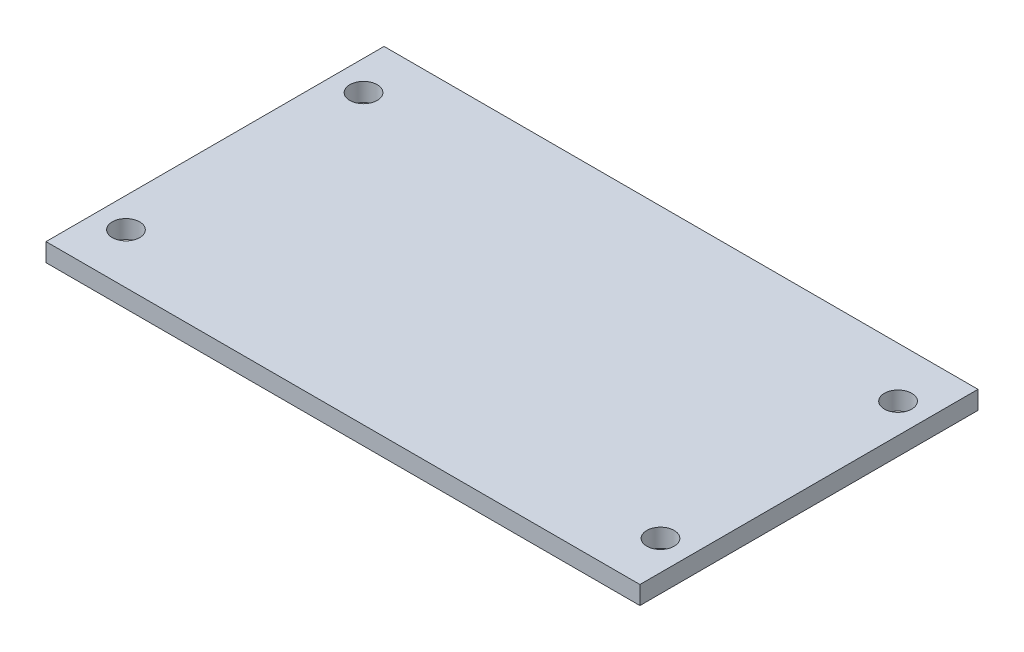
ISO-10303-21;
HEADER;
FILE_DESCRIPTION(('STEP AP214'),'2;1');
FILE_NAME('part.step','',(''),(''),'','','');
FILE_SCHEMA(('AUTOMOTIVE_DESIGN { 1 0 10303 214 1 1 1 1 }'));
ENDSEC;
DATA;
#1=APPLICATION_CONTEXT('core data for automotive mechanical design processes');
#2=APPLICATION_PROTOCOL_DEFINITION('international standard','automotive_design',2000,#1);
#3=PRODUCT_CONTEXT('',#1,'mechanical');
#4=PRODUCT('Part','Part','',(#3));
#5=PRODUCT_RELATED_PRODUCT_CATEGORY('part','',(#4));
#6=PRODUCT_DEFINITION_FORMATION('','',#4);
#7=PRODUCT_DEFINITION_CONTEXT('part definition',#1,'design');
#8=PRODUCT_DEFINITION('design','',#6,#7);
#9=PRODUCT_DEFINITION_SHAPE('','',#8);
#10=(LENGTH_UNIT() NAMED_UNIT(*) SI_UNIT(.MILLI.,.METRE.));
#11=(NAMED_UNIT(*) PLANE_ANGLE_UNIT() SI_UNIT($,.RADIAN.));
#12=(NAMED_UNIT(*) SI_UNIT($,.STERADIAN.) SOLID_ANGLE_UNIT());
#13=UNCERTAINTY_MEASURE_WITH_UNIT(LENGTH_MEASURE(1.E-05),#10,'distance_accuracy_value','');
#14=(GEOMETRIC_REPRESENTATION_CONTEXT(3) GLOBAL_UNCERTAINTY_ASSIGNED_CONTEXT((#13)) GLOBAL_UNIT_ASSIGNED_CONTEXT((#10,
#11,#12)) REPRESENTATION_CONTEXT('',''));
#15=CARTESIAN_POINT('',(0.,0.,0.));
#16=DIRECTION('',(0.,0.,1.));
#17=DIRECTION('',(1.,0.,0.));
#18=AXIS2_PLACEMENT_3D('',#15,#16,#17);
#19=CARTESIAN_POINT('',(17.5,0.,10.));
#20=DIRECTION('',(0.,1.,0.));
#21=DIRECTION('',(-1.,0.,0.));
#22=AXIS2_PLACEMENT_3D('',#19,#20,#21);
#23=PLANE('',#22);
#24=DIRECTION('',(1.,0.,0.));
#25=VECTOR('',#24,1.);
#26=CARTESIAN_POINT('',(17.5,0.,0.));
#27=LINE('',#26,#25);
#28=CARTESIAN_POINT('',(-17.5,0.,0.));
#29=VERTEX_POINT('',#28);
#30=CARTESIAN_POINT('',(17.5,0.,0.));
#31=VERTEX_POINT('',#30);
#32=EDGE_CURVE('E167',#29,#31,#27,.T.);
#33=ORIENTED_EDGE('',*,*,#32,.T.);
#34=DIRECTION('',(0.,0.,-1.));
#35=VECTOR('',#34,1.);
#36=CARTESIAN_POINT('',(17.5,0.,10.));
#37=LINE('',#36,#35);
#38=CARTESIAN_POINT('',(17.5,0.,10.));
#39=VERTEX_POINT('',#38);
#40=EDGE_CURVE('E11',#39,#31,#37,.T.);
#41=ORIENTED_EDGE('',*,*,#40,.F.);
#42=DIRECTION('',(1.,0.,0.));
#43=VECTOR('',#42,1.);
#44=CARTESIAN_POINT('',(17.5,0.,10.));
#45=LINE('',#44,#43);
#46=CARTESIAN_POINT('',(-17.5,0.,10.));
#47=VERTEX_POINT('',#46);
#48=EDGE_CURVE('E204',#47,#39,#45,.T.);
#49=ORIENTED_EDGE('',*,*,#48,.F.);
#50=DIRECTION('',(0.,0.,-1.));
#51=VECTOR('',#50,1.);
#52=CARTESIAN_POINT('',(-17.5,0.,10.));
#53=LINE('',#52,#51);
#54=EDGE_CURVE('E163',#47,#29,#53,.T.);
#55=ORIENTED_EDGE('',*,*,#54,.T.);
#56=EDGE_LOOP('',(#33,#41,#49,#55));
#57=FACE_BOUND('',#56,.T.);
#58=ADVANCED_FACE('F42',(#57),#23,.F.);
#59=CARTESIAN_POINT('',(17.5,-1.,10.));
#60=DIRECTION('',(1.,0.,0.));
#61=DIRECTION('',(0.,0.,-1.));
#62=AXIS2_PLACEMENT_3D('',#59,#60,#61);
#63=PLANE('',#62);
#64=DIRECTION('',(0.,-1.,0.));
#65=VECTOR('',#64,1.);
#66=CARTESIAN_POINT('',(17.5,-1.,0.));
#67=LINE('',#66,#65);
#68=CARTESIAN_POINT('',(17.5,-1.,0.));
#69=VERTEX_POINT('',#68);
#70=EDGE_CURVE('E171',#31,#69,#67,.T.);
#71=ORIENTED_EDGE('',*,*,#70,.T.);
#72=DIRECTION('',(0.,0.,-1.));
#73=VECTOR('',#72,1.);
#74=CARTESIAN_POINT('',(17.5,-1.,10.));
#75=LINE('',#74,#73);
#76=CARTESIAN_POINT('',(17.5,-1.,10.));
#77=VERTEX_POINT('',#76);
#78=EDGE_CURVE('E51',#77,#69,#75,.T.);
#79=ORIENTED_EDGE('',*,*,#78,.F.);
#80=DIRECTION('',(0.,-1.,0.));
#81=VECTOR('',#80,1.);
#82=CARTESIAN_POINT('',(17.5,-1.,10.));
#83=LINE('',#82,#81);
#84=EDGE_CURVE('E112',#39,#77,#83,.T.);
#85=ORIENTED_EDGE('',*,*,#84,.F.);
#86=ORIENTED_EDGE('',*,*,#40,.T.);
#87=EDGE_LOOP('',(#71,#79,#85,#86));
#88=FACE_BOUND('',#87,.T.);
#89=ADVANCED_FACE('F298',(#88),#63,.F.);
#90=CARTESIAN_POINT('',(14.5,-1.,10.));
#91=DIRECTION('',(0.,-1.,0.));
#92=DIRECTION('',(0.,0.,-1.));
#93=AXIS2_PLACEMENT_3D('',#90,#91,#92);
#94=PLANE('',#93);
#95=DIRECTION('',(-1.,0.,0.));
#96=VECTOR('',#95,1.);
#97=CARTESIAN_POINT('',(14.5,-1.,0.));
#98=LINE('',#97,#96);
#99=CARTESIAN_POINT('',(14.5,-1.,0.));
#100=VERTEX_POINT('',#99);
#101=EDGE_CURVE('E175',#69,#100,#98,.T.);
#102=ORIENTED_EDGE('',*,*,#101,.T.);
#103=DIRECTION('',(0.,0.,-1.));
#104=VECTOR('',#103,1.);
#105=CARTESIAN_POINT('',(14.5,-1.,10.));
#106=LINE('',#105,#104);
#107=CARTESIAN_POINT('',(14.5,-1.,10.));
#108=VERTEX_POINT('',#107);
#109=EDGE_CURVE('E231',#108,#100,#106,.T.);
#110=ORIENTED_EDGE('',*,*,#109,.F.);
#111=DIRECTION('',(-1.,0.,0.));
#112=VECTOR('',#111,1.);
#113=CARTESIAN_POINT('',(14.5,-1.,10.));
#114=LINE('',#113,#112);
#115=EDGE_CURVE('E241',#77,#108,#114,.T.);
#116=ORIENTED_EDGE('',*,*,#115,.F.);
#117=ORIENTED_EDGE('',*,*,#78,.T.);
#118=EDGE_LOOP('',(#102,#110,#116,#117));
#119=FACE_BOUND('',#118,.T.);
#120=ADVANCED_FACE('F239',(#119),#94,.F.);
#121=CARTESIAN_POINT('',(14.5,-5.,10.));
#122=DIRECTION('',(1.,0.,0.));
#123=DIRECTION('',(0.,0.,-1.));
#124=AXIS2_PLACEMENT_3D('',#121,#122,#123);
#125=PLANE('',#124);
#126=DIRECTION('',(0.,-1.,0.));
#127=VECTOR('',#126,1.);
#128=CARTESIAN_POINT('',(14.5,-5.,0.));
#129=LINE('',#128,#127);
#130=CARTESIAN_POINT('',(14.5,-5.,0.));
#131=VERTEX_POINT('',#130);
#132=EDGE_CURVE('E178',#100,#131,#129,.T.);
#133=ORIENTED_EDGE('',*,*,#132,.T.);
#134=DIRECTION('',(0.,0.,-1.));
#135=VECTOR('',#134,1.);
#136=CARTESIAN_POINT('',(14.5,-5.,10.));
#137=LINE('',#136,#135);
#138=CARTESIAN_POINT('',(14.5,-5.,10.));
#139=VERTEX_POINT('',#138);
#140=EDGE_CURVE('E227',#139,#131,#137,.T.);
#141=ORIENTED_EDGE('',*,*,#140,.F.);
#142=DIRECTION('',(0.,-1.,0.));
#143=VECTOR('',#142,1.);
#144=CARTESIAN_POINT('',(14.5,-5.,10.));
#145=LINE('',#144,#143);
#146=EDGE_CURVE('E260',#108,#139,#145,.T.);
#147=ORIENTED_EDGE('',*,*,#146,.F.);
#148=ORIENTED_EDGE('',*,*,#109,.T.);
#149=EDGE_LOOP('',(#133,#141,#147,#148));
#150=FACE_BOUND('',#149,.T.);
#151=ADVANCED_FACE('F250',(#150),#125,.F.);
#152=CARTESIAN_POINT('',(22.5,-5.,10.));
#153=DIRECTION('',(0.,1.,0.));
#154=DIRECTION('',(-1.,0.,0.));
#155=AXIS2_PLACEMENT_3D('',#152,#153,#154);
#156=PLANE('',#155);
#157=DIRECTION('',(1.,0.,0.));
#158=VECTOR('',#157,1.);
#159=CARTESIAN_POINT('',(22.5,-5.,0.));
#160=LINE('',#159,#158);
#161=CARTESIAN_POINT('',(22.5,-5.,0.));
#162=VERTEX_POINT('',#161);
#163=EDGE_CURVE('E181',#131,#162,#160,.T.);
#164=ORIENTED_EDGE('',*,*,#163,.T.);
#165=DIRECTION('',(0.,0.,-1.));
#166=VECTOR('',#165,1.);
#167=CARTESIAN_POINT('',(22.5,-5.,10.));
#168=LINE('',#167,#166);
#169=CARTESIAN_POINT('',(22.5,-5.,10.));
#170=VERTEX_POINT('',#169);
#171=EDGE_CURVE('E223',#170,#162,#168,.T.);
#172=ORIENTED_EDGE('',*,*,#171,.F.);
#173=DIRECTION('',(1.,0.,0.));
#174=VECTOR('',#173,1.);
#175=CARTESIAN_POINT('',(22.5,-5.,10.));
#176=LINE('',#175,#174);
#177=EDGE_CURVE('E256',#139,#170,#176,.T.);
#178=ORIENTED_EDGE('',*,*,#177,.F.);
#179=ORIENTED_EDGE('',*,*,#140,.T.);
#180=EDGE_LOOP('',(#164,#172,#178,#179));
#181=FACE_BOUND('',#180,.T.);
#182=ADVANCED_FACE('F254',(#181),#156,.F.);
#183=CARTESIAN_POINT('',(22.5,4.,10.));
#184=DIRECTION('',(-1.,0.,0.));
#185=DIRECTION('',(0.,0.,1.));
#186=AXIS2_PLACEMENT_3D('',#183,#184,#185);
#187=PLANE('',#186);
#188=DIRECTION('',(0.,1.,0.));
#189=VECTOR('',#188,1.);
#190=CARTESIAN_POINT('',(22.5,4.,0.));
#191=LINE('',#190,#189);
#192=CARTESIAN_POINT('',(22.5,4.,0.));
#193=VERTEX_POINT('',#192);
#194=EDGE_CURVE('E184',#162,#193,#191,.T.);
#195=ORIENTED_EDGE('',*,*,#194,.T.);
#196=DIRECTION('',(0.,0.,-1.));
#197=VECTOR('',#196,1.);
#198=CARTESIAN_POINT('',(22.5,4.,10.));
#199=LINE('',#198,#197);
#200=CARTESIAN_POINT('',(22.5,4.,10.));
#201=VERTEX_POINT('',#200);
#202=EDGE_CURVE('E219',#201,#193,#199,.T.);
#203=ORIENTED_EDGE('',*,*,#202,.F.);
#204=DIRECTION('',(0.,1.,0.));
#205=VECTOR('',#204,1.);
#206=CARTESIAN_POINT('',(22.5,4.,10.));
#207=LINE('',#206,#205);
#208=EDGE_CURVE('E259',#170,#201,#207,.T.);
#209=ORIENTED_EDGE('',*,*,#208,.F.);
#210=ORIENTED_EDGE('',*,*,#171,.T.);
#211=EDGE_LOOP('',(#195,#203,#209,#210));
#212=FACE_BOUND('',#211,.T.);
#213=ADVANCED_FACE('F311',(#212),#187,.F.);
#214=CARTESIAN_POINT('',(-22.5,-5.,10.));
#215=DIRECTION('',(1.,0.,0.));
#216=DIRECTION('',(0.,0.,-1.));
#217=AXIS2_PLACEMENT_3D('',#214,#215,#216);
#218=PLANE('',#217);
#219=DIRECTION('',(0.,-1.,0.));
#220=VECTOR('',#219,1.);
#221=CARTESIAN_POINT('',(-22.5,-5.,0.));
#222=LINE('',#221,#220);
#223=CARTESIAN_POINT('',(-22.5,4.,0.));
#224=VERTEX_POINT('',#223);
#225=CARTESIAN_POINT('',(-22.5,-5.,0.));
#226=VERTEX_POINT('',#225);
#227=EDGE_CURVE('E192',#224,#226,#222,.T.);
#228=ORIENTED_EDGE('',*,*,#227,.T.);
#229=DIRECTION('',(0.,0.,-1.));
#230=VECTOR('',#229,1.);
#231=CARTESIAN_POINT('',(-22.5,-5.,10.));
#232=LINE('',#231,#230);
#233=CARTESIAN_POINT('',(-22.5,-5.,10.));
#234=VERTEX_POINT('',#233);
#235=EDGE_CURVE('E211',#234,#226,#232,.T.);
#236=ORIENTED_EDGE('',*,*,#235,.F.);
#237=DIRECTION('',(0.,-1.,0.));
#238=VECTOR('',#237,1.);
#239=CARTESIAN_POINT('',(-22.5,0.,10.));
#240=LINE('',#239,#238);
#241=CARTESIAN_POINT('',(-22.5,4.,10.));
#242=VERTEX_POINT('',#241);
#243=EDGE_CURVE('E271',#242,#234,#240,.T.);
#244=ORIENTED_EDGE('',*,*,#243,.F.);
#245=DIRECTION('',(0.,0.,-1.));
#246=VECTOR('',#245,1.);
#247=CARTESIAN_POINT('',(-22.5,4.,10.));
#248=LINE('',#247,#246);
#249=EDGE_CURVE('E215',#242,#224,#248,.T.);
#250=ORIENTED_EDGE('',*,*,#249,.T.);
#251=EDGE_LOOP('',(#228,#236,#244,#250));
#252=FACE_BOUND('',#251,.T.);
#253=ADVANCED_FACE('F279',(#252),#218,.F.);
#254=CARTESIAN_POINT('',(-14.5,-5.,10.));
#255=DIRECTION('',(0.,1.,0.));
#256=DIRECTION('',(0.,0.,1.));
#257=AXIS2_PLACEMENT_3D('',#254,#255,#256);
#258=PLANE('',#257);
#259=DIRECTION('',(1.,0.,0.));
#260=VECTOR('',#259,1.);
#261=CARTESIAN_POINT('',(-14.5,-5.,0.));
#262=LINE('',#261,#260);
#263=CARTESIAN_POINT('',(-14.5,-5.,0.));
#264=VERTEX_POINT('',#263);
#265=EDGE_CURVE('E195',#226,#264,#262,.T.);
#266=ORIENTED_EDGE('',*,*,#265,.T.);
#267=DIRECTION('',(0.,0.,-1.));
#268=VECTOR('',#267,1.);
#269=CARTESIAN_POINT('',(-14.5,-5.,10.));
#270=LINE('',#269,#268);
#271=CARTESIAN_POINT('',(-14.5,-5.,10.));
#272=VERTEX_POINT('',#271);
#273=EDGE_CURVE('E156',#272,#264,#270,.T.);
#274=ORIENTED_EDGE('',*,*,#273,.F.);
#275=DIRECTION('',(1.,0.,0.));
#276=VECTOR('',#275,1.);
#277=CARTESIAN_POINT('',(-14.5,-5.,10.));
#278=LINE('',#277,#276);
#279=EDGE_CURVE('E145',#234,#272,#278,.T.);
#280=ORIENTED_EDGE('',*,*,#279,.F.);
#281=ORIENTED_EDGE('',*,*,#235,.T.);
#282=EDGE_LOOP('',(#266,#274,#280,#281));
#283=FACE_BOUND('',#282,.T.);
#284=ADVANCED_FACE('F282',(#283),#258,.F.);
#285=CARTESIAN_POINT('',(-14.5,-1.,10.));
#286=DIRECTION('',(-1.,0.,0.));
#287=DIRECTION('',(0.,0.,1.));
#288=AXIS2_PLACEMENT_3D('',#285,#286,#287);
#289=PLANE('',#288);
#290=DIRECTION('',(0.,1.,0.));
#291=VECTOR('',#290,1.);
#292=CARTESIAN_POINT('',(-14.5,-1.,0.));
#293=LINE('',#292,#291);
#294=CARTESIAN_POINT('',(-14.5,-1.,0.));
#295=VERTEX_POINT('',#294);
#296=EDGE_CURVE('E154',#264,#295,#293,.T.);
#297=ORIENTED_EDGE('',*,*,#296,.T.);
#298=DIRECTION('',(0.,0.,-1.));
#299=VECTOR('',#298,1.);
#300=CARTESIAN_POINT('',(-14.5,-1.,10.));
#301=LINE('',#300,#299);
#302=CARTESIAN_POINT('',(-14.5,-1.,10.));
#303=VERTEX_POINT('',#302);
#304=EDGE_CURVE('E151',#303,#295,#301,.T.);
#305=ORIENTED_EDGE('',*,*,#304,.F.);
#306=DIRECTION('',(0.,1.,0.));
#307=VECTOR('',#306,1.);
#308=CARTESIAN_POINT('',(-14.5,-1.,10.));
#309=LINE('',#308,#307);
#310=EDGE_CURVE('E139',#272,#303,#309,.T.);
#311=ORIENTED_EDGE('',*,*,#310,.F.);
#312=ORIENTED_EDGE('',*,*,#273,.T.);
#313=EDGE_LOOP('',(#297,#305,#311,#312));
#314=FACE_BOUND('',#313,.T.);
#315=ADVANCED_FACE('F152',(#314),#289,.F.);
#316=CARTESIAN_POINT('',(-17.5,-1.,10.));
#317=DIRECTION('',(0.,-1.,0.));
#318=DIRECTION('',(0.,0.,-1.));
#319=AXIS2_PLACEMENT_3D('',#316,#317,#318);
#320=PLANE('',#319);
#321=DIRECTION('',(-1.,0.,0.));
#322=VECTOR('',#321,1.);
#323=CARTESIAN_POINT('',(-17.5,-1.,0.));
#324=LINE('',#323,#322);
#325=CARTESIAN_POINT('',(-17.5,-1.,0.));
#326=VERTEX_POINT('',#325);
#327=EDGE_CURVE('E98',#295,#326,#324,.T.);
#328=ORIENTED_EDGE('',*,*,#327,.T.);
#329=DIRECTION('',(0.,0.,-1.));
#330=VECTOR('',#329,1.);
#331=CARTESIAN_POINT('',(-17.5,-1.,10.));
#332=LINE('',#331,#330);
#333=CARTESIAN_POINT('',(-17.5,-1.,10.));
#334=VERTEX_POINT('',#333);
#335=EDGE_CURVE('E157',#334,#326,#332,.T.);
#336=ORIENTED_EDGE('',*,*,#335,.F.);
#337=DIRECTION('',(-1.,0.,0.));
#338=VECTOR('',#337,1.);
#339=CARTESIAN_POINT('',(-17.5,-1.,10.));
#340=LINE('',#339,#338);
#341=EDGE_CURVE('E143',#303,#334,#340,.T.);
#342=ORIENTED_EDGE('',*,*,#341,.F.);
#343=ORIENTED_EDGE('',*,*,#304,.T.);
#344=EDGE_LOOP('',(#328,#336,#342,#343));
#345=FACE_BOUND('',#344,.T.);
#346=ADVANCED_FACE('F159',(#345),#320,.F.);
#347=CARTESIAN_POINT('',(-17.5,0.,10.));
#348=DIRECTION('',(-1.,0.,0.));
#349=DIRECTION('',(0.,0.,1.));
#350=AXIS2_PLACEMENT_3D('',#347,#348,#349);
#351=PLANE('',#350);
#352=DIRECTION('',(0.,1.,0.));
#353=VECTOR('',#352,1.);
#354=CARTESIAN_POINT('',(-17.5,0.,0.));
#355=LINE('',#354,#353);
#356=EDGE_CURVE('E104',#326,#29,#355,.T.);
#357=ORIENTED_EDGE('',*,*,#356,.T.);
#358=ORIENTED_EDGE('',*,*,#54,.F.);
#359=DIRECTION('',(0.,1.,0.));
#360=VECTOR('',#359,1.);
#361=CARTESIAN_POINT('',(-17.5,0.,10.));
#362=LINE('',#361,#360);
#363=EDGE_CURVE('E59',#334,#47,#362,.T.);
#364=ORIENTED_EDGE('',*,*,#363,.F.);
#365=ORIENTED_EDGE('',*,*,#335,.T.);
#366=EDGE_LOOP('',(#357,#358,#364,#365));
#367=FACE_BOUND('',#366,.T.);
#368=ADVANCED_FACE('F286',(#367),#351,.F.);
#369=CARTESIAN_POINT('',(0.,0.,10.));
#370=DIRECTION('',(0.,0.,1.));
#371=DIRECTION('',(1.,0.,0.));
#372=AXIS2_PLACEMENT_3D('',#369,#370,#371);
#373=PLANE('',#372);
#374=ORIENTED_EDGE('',*,*,#48,.T.);
#375=ORIENTED_EDGE('',*,*,#84,.T.);
#376=ORIENTED_EDGE('',*,*,#115,.T.);
#377=ORIENTED_EDGE('',*,*,#146,.T.);
#378=ORIENTED_EDGE('',*,*,#177,.T.);
#379=ORIENTED_EDGE('',*,*,#208,.T.);
#380=DIRECTION('',(-1.,0.,0.));
#381=VECTOR('',#380,1.);
#382=CARTESIAN_POINT('',(-22.5,4.,10.));
#383=LINE('',#382,#381);
#384=EDGE_CURVE('E264',#201,#242,#383,.T.);
#385=ORIENTED_EDGE('',*,*,#384,.T.);
#386=ORIENTED_EDGE('',*,*,#243,.T.);
#387=ORIENTED_EDGE('',*,*,#279,.T.);
#388=ORIENTED_EDGE('',*,*,#310,.T.);
#389=ORIENTED_EDGE('',*,*,#341,.T.);
#390=ORIENTED_EDGE('',*,*,#363,.T.);
#391=EDGE_LOOP('',(#374,#375,#376,#377,#378,#379,#385,#386,#387,#388,#389,#390));
#392=FACE_BOUND('',#391,.T.);
#393=ADVANCED_FACE('F141',(#392),#373,.T.);
#394=CARTESIAN_POINT('',(0.,0.,0.));
#395=DIRECTION('',(0.,0.,1.));
#396=DIRECTION('',(1.,0.,0.));
#397=AXIS2_PLACEMENT_3D('',#394,#395,#396);
#398=PLANE('',#397);
#399=ORIENTED_EDGE('',*,*,#32,.F.);
#400=ORIENTED_EDGE('',*,*,#356,.F.);
#401=ORIENTED_EDGE('',*,*,#327,.F.);
#402=ORIENTED_EDGE('',*,*,#296,.F.);
#403=ORIENTED_EDGE('',*,*,#265,.F.);
#404=ORIENTED_EDGE('',*,*,#227,.F.);
#405=DIRECTION('',(-1.,0.,0.));
#406=VECTOR('',#405,1.);
#407=CARTESIAN_POINT('',(-22.5,4.,0.));
#408=LINE('',#407,#406);
#409=EDGE_CURVE('E188',#193,#224,#408,.T.);
#410=ORIENTED_EDGE('',*,*,#409,.F.);
#411=ORIENTED_EDGE('',*,*,#194,.F.);
#412=ORIENTED_EDGE('',*,*,#163,.F.);
#413=ORIENTED_EDGE('',*,*,#132,.F.);
#414=ORIENTED_EDGE('',*,*,#101,.F.);
#415=ORIENTED_EDGE('',*,*,#70,.F.);
#416=EDGE_LOOP('',(#399,#400,#401,#402,#403,#404,#410,#411,#412,#413,#414,#415));
#417=FACE_BOUND('',#416,.T.);
#418=ADVANCED_FACE('F245',(#417),#398,.F.);
#419=CARTESIAN_POINT('',(0.,4.,0.));
#420=DIRECTION('',(0.,1.,0.));
#421=DIRECTION('',(-1.,0.,0.));
#422=AXIS2_PLACEMENT_3D('',#419,#420,#421);
#423=PLANE('',#422);
#424=CARTESIAN_POINT('',(29.25,4.,-7.99999999999998));
#425=DIRECTION('',(0.,1.,0.));
#426=DIRECTION('',(-1.,0.,0.));
#427=AXIS2_PLACEMENT_3D('',#424,#425,#426);
#428=CIRCLE('',#427,1.5);
#429=CARTESIAN_POINT('',(27.75,4.,-7.99999999999998));
#430=VERTEX_POINT('',#429);
#431=EDGE_CURVE('E547',#430,#430,#428,.T.);
#432=ORIENTED_EDGE('',*,*,#431,.T.);
#433=EDGE_LOOP('',(#432));
#434=FACE_BOUND('',#433,.T.);
#435=CARTESIAN_POINT('',(29.25,4.,18.));
#436=DIRECTION('',(0.,1.,0.));
#437=DIRECTION('',(-1.,0.,0.));
#438=AXIS2_PLACEMENT_3D('',#435,#436,#437);
#439=CIRCLE('',#438,1.5);
#440=CARTESIAN_POINT('',(27.75,4.,18.));
#441=VERTEX_POINT('',#440);
#442=EDGE_CURVE('E550',#441,#441,#439,.T.);
#443=ORIENTED_EDGE('',*,*,#442,.T.);
#444=EDGE_LOOP('',(#443));
#445=FACE_BOUND('',#444,.T.);
#446=CARTESIAN_POINT('',(-29.25,4.,18.));
#447=DIRECTION('',(0.,1.,0.));
#448=DIRECTION('',(-1.,0.,0.));
#449=AXIS2_PLACEMENT_3D('',#446,#447,#448);
#450=CIRCLE('',#449,1.5);
#451=CARTESIAN_POINT('',(-30.75,4.,18.));
#452=VERTEX_POINT('',#451);
#453=EDGE_CURVE('E558',#452,#452,#450,.T.);
#454=ORIENTED_EDGE('',*,*,#453,.T.);
#455=EDGE_LOOP('',(#454));
#456=FACE_BOUND('',#455,.T.);
#457=CARTESIAN_POINT('',(-29.25,4.,-7.99999999999998));
#458=DIRECTION('',(0.,1.,0.));
#459=DIRECTION('',(-1.,0.,0.));
#460=AXIS2_PLACEMENT_3D('',#457,#458,#459);
#461=CIRCLE('',#460,1.5);
#462=CARTESIAN_POINT('',(-30.75,4.,-7.99999999999998));
#463=VERTEX_POINT('',#462);
#464=EDGE_CURVE('E643',#463,#463,#461,.T.);
#465=ORIENTED_EDGE('',*,*,#464,.T.);
#466=EDGE_LOOP('',(#465));
#467=FACE_BOUND('',#466,.T.);
#468=DIRECTION('',(0.,0.,1.));
#469=VECTOR('',#468,1.);
#470=CARTESIAN_POINT('',(-32.5,4.,23.5));
#471=LINE('',#470,#469);
#472=CARTESIAN_POINT('',(-32.5,4.,-13.5));
#473=VERTEX_POINT('',#472);
#474=CARTESIAN_POINT('',(-32.5,4.,23.5));
#475=VERTEX_POINT('',#474);
#476=EDGE_CURVE('E549',#473,#475,#471,.T.);
#477=ORIENTED_EDGE('',*,*,#476,.F.);
#478=DIRECTION('',(-1.,0.,0.));
#479=VECTOR('',#478,1.);
#480=CARTESIAN_POINT('',(32.5,4.,-13.5));
#481=LINE('',#480,#479);
#482=CARTESIAN_POINT('',(32.5,4.,-13.5));
#483=VERTEX_POINT('',#482);
#484=EDGE_CURVE('E567',#483,#473,#481,.T.);
#485=ORIENTED_EDGE('',*,*,#484,.F.);
#486=DIRECTION('',(0.,0.,-1.));
#487=VECTOR('',#486,1.);
#488=CARTESIAN_POINT('',(32.5,4.,23.5));
#489=LINE('',#488,#487);
#490=CARTESIAN_POINT('',(32.5,4.,23.5));
#491=VERTEX_POINT('',#490);
#492=EDGE_CURVE('E583',#491,#483,#489,.T.);
#493=ORIENTED_EDGE('',*,*,#492,.F.);
#494=DIRECTION('',(1.,0.,0.));
#495=VECTOR('',#494,1.);
#496=CARTESIAN_POINT('',(32.5,4.,23.5));
#497=LINE('',#496,#495);
#498=EDGE_CURVE('E555',#475,#491,#497,.T.);
#499=ORIENTED_EDGE('',*,*,#498,.F.);
#500=EDGE_LOOP('',(#477,#485,#493,#499));
#501=FACE_BOUND('',#500,.T.);
#502=ORIENTED_EDGE('',*,*,#202,.T.);
#503=ORIENTED_EDGE('',*,*,#409,.T.);
#504=ORIENTED_EDGE('',*,*,#249,.F.);
#505=ORIENTED_EDGE('',*,*,#384,.F.);
#506=EDGE_LOOP('',(#502,#503,#504,#505));
#507=FACE_BOUND('',#506,.T.);
#508=ADVANCED_FACE('F353',(#434,#445,#456,#467,#501,#507),#423,.F.);
#509=CARTESIAN_POINT('',(-32.5,6.,23.5));
#510=DIRECTION('',(1.,0.,0.));
#511=DIRECTION('',(0.,1.,0.));
#512=AXIS2_PLACEMENT_3D('',#509,#510,#511);
#513=PLANE('',#512);
#514=ORIENTED_EDGE('',*,*,#476,.T.);
#515=DIRECTION('',(0.,-1.,0.));
#516=VECTOR('',#515,1.);
#517=CARTESIAN_POINT('',(-32.5,6.,23.5));
#518=LINE('',#517,#516);
#519=CARTESIAN_POINT('',(-32.5,6.,23.5));
#520=VERTEX_POINT('',#519);
#521=EDGE_CURVE('E172',#520,#475,#518,.T.);
#522=ORIENTED_EDGE('',*,*,#521,.F.);
#523=DIRECTION('',(0.,0.,1.));
#524=VECTOR('',#523,1.);
#525=CARTESIAN_POINT('',(-32.5,6.,23.5));
#526=LINE('',#525,#524);
#527=CARTESIAN_POINT('',(-32.5,6.,-13.5));
#528=VERTEX_POINT('',#527);
#529=EDGE_CURVE('E562',#528,#520,#526,.T.);
#530=ORIENTED_EDGE('',*,*,#529,.F.);
#531=DIRECTION('',(0.,-1.,0.));
#532=VECTOR('',#531,1.);
#533=CARTESIAN_POINT('',(-32.5,6.,-13.5));
#534=LINE('',#533,#532);
#535=EDGE_CURVE('E578',#528,#473,#534,.T.);
#536=ORIENTED_EDGE('',*,*,#535,.T.);
#537=EDGE_LOOP('',(#514,#522,#530,#536));
#538=FACE_BOUND('',#537,.T.);
#539=ADVANCED_FACE('F357',(#538),#513,.F.);
#540=CARTESIAN_POINT('',(32.5,6.,23.5));
#541=DIRECTION('',(0.,0.,-1.));
#542=DIRECTION('',(-1.,0.,0.));
#543=AXIS2_PLACEMENT_3D('',#540,#541,#542);
#544=PLANE('',#543);
#545=ORIENTED_EDGE('',*,*,#498,.T.);
#546=DIRECTION('',(0.,-1.,0.));
#547=VECTOR('',#546,1.);
#548=CARTESIAN_POINT('',(32.5,6.,23.5));
#549=LINE('',#548,#547);
#550=CARTESIAN_POINT('',(32.5,6.,23.5));
#551=VERTEX_POINT('',#550);
#552=EDGE_CURVE('E597',#551,#491,#549,.T.);
#553=ORIENTED_EDGE('',*,*,#552,.F.);
#554=DIRECTION('',(1.,0.,0.));
#555=VECTOR('',#554,1.);
#556=CARTESIAN_POINT('',(32.5,6.,23.5));
#557=LINE('',#556,#555);
#558=EDGE_CURVE('E566',#520,#551,#557,.T.);
#559=ORIENTED_EDGE('',*,*,#558,.F.);
#560=ORIENTED_EDGE('',*,*,#521,.T.);
#561=EDGE_LOOP('',(#545,#553,#559,#560));
#562=FACE_BOUND('',#561,.T.);
#563=ADVANCED_FACE('F362',(#562),#544,.F.);
#564=CARTESIAN_POINT('',(32.5,6.,23.5));
#565=DIRECTION('',(-1.,0.,0.));
#566=DIRECTION('',(0.,-1.,0.));
#567=AXIS2_PLACEMENT_3D('',#564,#565,#566);
#568=PLANE('',#567);
#569=ORIENTED_EDGE('',*,*,#492,.T.);
#570=DIRECTION('',(0.,-1.,0.));
#571=VECTOR('',#570,1.);
#572=CARTESIAN_POINT('',(32.5,6.,-13.5));
#573=LINE('',#572,#571);
#574=CARTESIAN_POINT('',(32.5,6.,-13.5));
#575=VERTEX_POINT('',#574);
#576=EDGE_CURVE('E593',#575,#483,#573,.T.);
#577=ORIENTED_EDGE('',*,*,#576,.F.);
#578=DIRECTION('',(0.,0.,-1.));
#579=VECTOR('',#578,1.);
#580=CARTESIAN_POINT('',(32.5,6.,23.5));
#581=LINE('',#580,#579);
#582=EDGE_CURVE('E571',#551,#575,#581,.T.);
#583=ORIENTED_EDGE('',*,*,#582,.F.);
#584=ORIENTED_EDGE('',*,*,#552,.T.);
#585=EDGE_LOOP('',(#569,#577,#583,#584));
#586=FACE_BOUND('',#585,.T.);
#587=ADVANCED_FACE('F374',(#586),#568,.F.);
#588=CARTESIAN_POINT('',(32.5,6.,-13.5));
#589=DIRECTION('',(0.,0.,1.));
#590=DIRECTION('',(1.,0.,0.));
#591=AXIS2_PLACEMENT_3D('',#588,#589,#590);
#592=PLANE('',#591);
#593=ORIENTED_EDGE('',*,*,#484,.T.);
#594=ORIENTED_EDGE('',*,*,#535,.F.);
#595=DIRECTION('',(-1.,0.,0.));
#596=VECTOR('',#595,1.);
#597=CARTESIAN_POINT('',(32.5,6.,-13.5));
#598=LINE('',#597,#596);
#599=EDGE_CURVE('E575',#575,#528,#598,.T.);
#600=ORIENTED_EDGE('',*,*,#599,.F.);
#601=ORIENTED_EDGE('',*,*,#576,.T.);
#602=EDGE_LOOP('',(#593,#594,#600,#601));
#603=FACE_BOUND('',#602,.T.);
#604=ADVANCED_FACE('F385',(#603),#592,.F.);
#605=CARTESIAN_POINT('',(0.,6.,0.));
#606=DIRECTION('',(0.,1.,0.));
#607=DIRECTION('',(-1.,0.,0.));
#608=AXIS2_PLACEMENT_3D('',#605,#606,#607);
#609=PLANE('',#608);
#610=CARTESIAN_POINT('',(29.25,6.,-7.99999999999998));
#611=DIRECTION('',(0.,1.,0.));
#612=DIRECTION('',(-1.,0.,0.));
#613=AXIS2_PLACEMENT_3D('',#610,#611,#612);
#614=CIRCLE('',#613,1.5);
#615=CARTESIAN_POINT('',(27.75,6.,-7.99999999999998));
#616=VERTEX_POINT('',#615);
#617=EDGE_CURVE('E544',#616,#616,#614,.T.);
#618=ORIENTED_EDGE('',*,*,#617,.F.);
#619=EDGE_LOOP('',(#618));
#620=FACE_BOUND('',#619,.T.);
#621=CARTESIAN_POINT('',(29.25,6.,18.));
#622=DIRECTION('',(0.,1.,0.));
#623=DIRECTION('',(-1.,0.,0.));
#624=AXIS2_PLACEMENT_3D('',#621,#622,#623);
#625=CIRCLE('',#624,1.5);
#626=CARTESIAN_POINT('',(27.75,6.,18.));
#627=VERTEX_POINT('',#626);
#628=EDGE_CURVE('E654',#627,#627,#625,.T.);
#629=ORIENTED_EDGE('',*,*,#628,.F.);
#630=EDGE_LOOP('',(#629));
#631=FACE_BOUND('',#630,.T.);
#632=CARTESIAN_POINT('',(-29.25,6.,18.));
#633=DIRECTION('',(0.,1.,0.));
#634=DIRECTION('',(-1.,0.,0.));
#635=AXIS2_PLACEMENT_3D('',#632,#633,#634);
#636=CIRCLE('',#635,1.5);
#637=CARTESIAN_POINT('',(-30.75,6.,18.));
#638=VERTEX_POINT('',#637);
#639=EDGE_CURVE('E651',#638,#638,#636,.T.);
#640=ORIENTED_EDGE('',*,*,#639,.F.);
#641=EDGE_LOOP('',(#640));
#642=FACE_BOUND('',#641,.T.);
#643=CARTESIAN_POINT('',(-29.25,6.,-7.99999999999998));
#644=DIRECTION('',(0.,1.,0.));
#645=DIRECTION('',(-1.,0.,0.));
#646=AXIS2_PLACEMENT_3D('',#643,#644,#645);
#647=CIRCLE('',#646,1.5);
#648=CARTESIAN_POINT('',(-30.75,6.,-7.99999999999998));
#649=VERTEX_POINT('',#648);
#650=EDGE_CURVE('E647',#649,#649,#647,.T.);
#651=ORIENTED_EDGE('',*,*,#650,.F.);
#652=EDGE_LOOP('',(#651));
#653=FACE_BOUND('',#652,.T.);
#654=ORIENTED_EDGE('',*,*,#529,.T.);
#655=ORIENTED_EDGE('',*,*,#558,.T.);
#656=ORIENTED_EDGE('',*,*,#582,.T.);
#657=ORIENTED_EDGE('',*,*,#599,.T.);
#658=EDGE_LOOP('',(#654,#655,#656,#657));
#659=FACE_BOUND('',#658,.T.);
#660=ADVANCED_FACE('F396',(#620,#631,#642,#653,#659),#609,.T.);
#661=CARTESIAN_POINT('',(-29.25,0.999999999999997,-7.99999999999998));
#662=DIRECTION('',(0.,1.,0.));
#663=DIRECTION('',(-1.,0.,0.));
#664=AXIS2_PLACEMENT_3D('',#661,#662,#663);
#665=CYLINDRICAL_SURFACE('',#664,1.5);
#666=ORIENTED_EDGE('',*,*,#650,.T.);
#667=EDGE_LOOP('',(#666));
#668=FACE_BOUND('',#667,.T.);
#669=ORIENTED_EDGE('',*,*,#464,.F.);
#670=EDGE_LOOP('',(#669));
#671=FACE_BOUND('',#670,.T.);
#672=ADVANCED_FACE('F412',(#668,#671),#665,.F.);
#673=CARTESIAN_POINT('',(-29.25,0.999999999999997,18.));
#674=DIRECTION('',(0.,1.,0.));
#675=DIRECTION('',(-1.,0.,0.));
#676=AXIS2_PLACEMENT_3D('',#673,#674,#675);
#677=CYLINDRICAL_SURFACE('',#676,1.5);
#678=ORIENTED_EDGE('',*,*,#639,.T.);
#679=EDGE_LOOP('',(#678));
#680=FACE_BOUND('',#679,.T.);
#681=ORIENTED_EDGE('',*,*,#453,.F.);
#682=EDGE_LOOP('',(#681));
#683=FACE_BOUND('',#682,.T.);
#684=ADVANCED_FACE('F420',(#680,#683),#677,.F.);
#685=CARTESIAN_POINT('',(29.25,1.,18.));
#686=DIRECTION('',(0.,1.,0.));
#687=DIRECTION('',(-1.,0.,0.));
#688=AXIS2_PLACEMENT_3D('',#685,#686,#687);
#689=CYLINDRICAL_SURFACE('',#688,1.5);
#690=ORIENTED_EDGE('',*,*,#628,.T.);
#691=EDGE_LOOP('',(#690));
#692=FACE_BOUND('',#691,.T.);
#693=ORIENTED_EDGE('',*,*,#442,.F.);
#694=EDGE_LOOP('',(#693));
#695=FACE_BOUND('',#694,.T.);
#696=ADVANCED_FACE('F431',(#692,#695),#689,.F.);
#697=CARTESIAN_POINT('',(29.25,1.,-7.99999999999998));
#698=DIRECTION('',(0.,1.,0.));
#699=DIRECTION('',(-1.,0.,0.));
#700=AXIS2_PLACEMENT_3D('',#697,#698,#699);
#701=CYLINDRICAL_SURFACE('',#700,1.5);
#702=ORIENTED_EDGE('',*,*,#617,.T.);
#703=EDGE_LOOP('',(#702));
#704=FACE_BOUND('',#703,.T.);
#705=ORIENTED_EDGE('',*,*,#431,.F.);
#706=EDGE_LOOP('',(#705));
#707=FACE_BOUND('',#706,.T.);
#708=ADVANCED_FACE('F442',(#704,#707),#701,.F.);
#709=CLOSED_SHELL('',(#58,#89,#120,#151,#182,#213,#253,#284,#315,#346,#368,#393,#418,#508,#539,
#563,#587,#604,#660,#672,#684,#696,#708));
#710=MANIFOLD_SOLID_BREP('B2',#709);
#711=ADVANCED_BREP_SHAPE_REPRESENTATION('',(#18,#710),#14);
#712=SHAPE_DEFINITION_REPRESENTATION(#9,#711);
ENDSEC;
END-ISO-10303-21;
